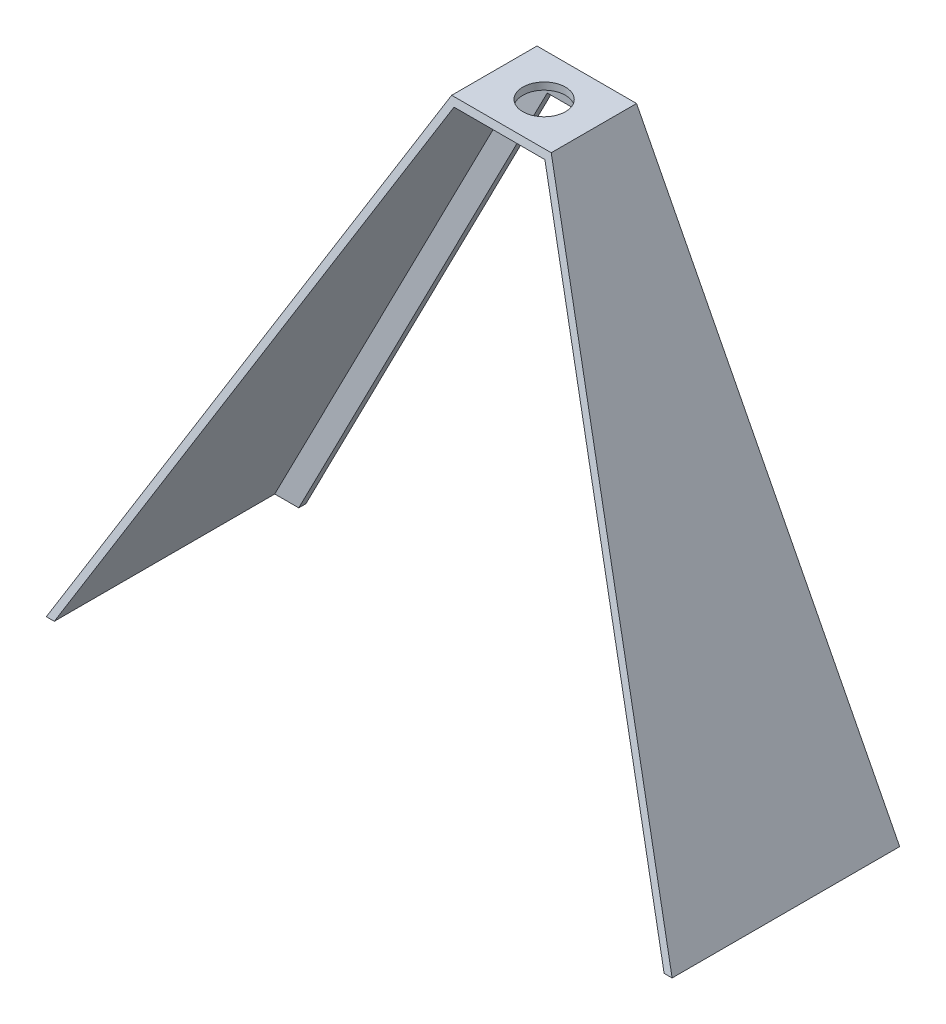
ISO-10303-21;
HEADER;
FILE_DESCRIPTION(('STEP AP214'),'2;1');
FILE_NAME('part.step','',(''),(''),'','','');
FILE_SCHEMA(('AUTOMOTIVE_DESIGN { 1 0 10303 214 1 1 1 1 }'));
ENDSEC;
DATA;
#1=APPLICATION_CONTEXT('core data for automotive mechanical design processes');
#2=APPLICATION_PROTOCOL_DEFINITION('international standard','automotive_design',2000,#1);
#3=PRODUCT_CONTEXT('',#1,'mechanical');
#4=PRODUCT('Part','Part','',(#3));
#5=PRODUCT_RELATED_PRODUCT_CATEGORY('part','',(#4));
#6=PRODUCT_DEFINITION_FORMATION('','',#4);
#7=PRODUCT_DEFINITION_CONTEXT('part definition',#1,'design');
#8=PRODUCT_DEFINITION('design','',#6,#7);
#9=PRODUCT_DEFINITION_SHAPE('','',#8);
#10=(LENGTH_UNIT() NAMED_UNIT(*) SI_UNIT(.MILLI.,.METRE.));
#11=(NAMED_UNIT(*) PLANE_ANGLE_UNIT() SI_UNIT($,.RADIAN.));
#12=(NAMED_UNIT(*) SI_UNIT($,.STERADIAN.) SOLID_ANGLE_UNIT());
#13=UNCERTAINTY_MEASURE_WITH_UNIT(LENGTH_MEASURE(1.E-05),#10,'distance_accuracy_value','');
#14=(GEOMETRIC_REPRESENTATION_CONTEXT(3) GLOBAL_UNCERTAINTY_ASSIGNED_CONTEXT((#13)) GLOBAL_UNIT_ASSIGNED_CONTEXT((#10,
#11,#12)) REPRESENTATION_CONTEXT('',''));
#15=CARTESIAN_POINT('',(0.,0.,0.));
#16=DIRECTION('',(0.,0.,1.));
#17=DIRECTION('',(1.,0.,0.));
#18=AXIS2_PLACEMENT_3D('',#15,#16,#17);
#19=CARTESIAN_POINT('',(279.4,1.04950770296597E-13,203.2));
#20=DIRECTION('',(0.,1.,0.));
#21=DIRECTION('',(-1.,0.,0.));
#22=AXIS2_PLACEMENT_3D('',#19,#20,#21);
#23=PLANE('',#22);
#24=DIRECTION('',(1.,0.,0.));
#25=VECTOR('',#24,1.);
#26=CARTESIAN_POINT('',(279.4,1.04950770296597E-13,0.));
#27=LINE('',#26,#25);
#28=CARTESIAN_POINT('',(-279.4,0.,0.));
#29=VERTEX_POINT('',#28);
#30=CARTESIAN_POINT('',(-250.842426438578,0.,0.));
#31=VERTEX_POINT('',#30);
#32=EDGE_CURVE('E196',#29,#31,#27,.T.);
#33=ORIENTED_EDGE('',*,*,#32,.T.);
#34=DIRECTION('',(0.,0.,-1.));
#35=VECTOR('',#34,1.);
#36=CARTESIAN_POINT('',(-250.842426438578,0.,203.2));
#37=LINE('',#36,#35);
#38=CARTESIAN_POINT('',(-250.842426438578,0.,6.34999999999999));
#39=VERTEX_POINT('',#38);
#40=EDGE_CURVE('E137',#39,#31,#37,.T.);
#41=ORIENTED_EDGE('',*,*,#40,.F.);
#42=DIRECTION('',(1.,0.,0.));
#43=VECTOR('',#42,1.);
#44=CARTESIAN_POINT('',(0.,0.,6.35));
#45=LINE('',#44,#43);
#46=CARTESIAN_POINT('',(-272.260606609644,0.,6.35));
#47=VERTEX_POINT('',#46);
#48=EDGE_CURVE('E161',#47,#39,#45,.T.);
#49=ORIENTED_EDGE('',*,*,#48,.F.);
#50=DIRECTION('',(0.,0.,-1.));
#51=VECTOR('',#50,1.);
#52=CARTESIAN_POINT('',(-272.260606609644,0.,203.2));
#53=LINE('',#52,#51);
#54=CARTESIAN_POINT('',(-272.260606609644,0.,203.2));
#55=VERTEX_POINT('',#54);
#56=EDGE_CURVE('E163',#55,#47,#53,.T.);
#57=ORIENTED_EDGE('',*,*,#56,.F.);
#58=DIRECTION('',(1.,0.,0.));
#59=VECTOR('',#58,1.);
#60=CARTESIAN_POINT('',(279.4,1.04950770296597E-13,203.2));
#61=LINE('',#60,#59);
#62=CARTESIAN_POINT('',(-279.4,0.,203.2));
#63=VERTEX_POINT('',#62);
#64=EDGE_CURVE('E191',#63,#55,#61,.T.);
#65=ORIENTED_EDGE('',*,*,#64,.F.);
#66=DIRECTION('',(0.,0.,-1.));
#67=VECTOR('',#66,1.);
#68=CARTESIAN_POINT('',(-279.4,0.,203.2));
#69=LINE('',#68,#67);
#70=EDGE_CURVE('E194',#63,#29,#69,.T.);
#71=ORIENTED_EDGE('',*,*,#70,.T.);
#72=EDGE_LOOP('',(#33,#41,#49,#57,#65,#71));
#73=FACE_BOUND('',#72,.T.);
#74=ADVANCED_FACE('F33',(#73),#23,.F.);
#75=CARTESIAN_POINT('',(250.842426438578,0.,6.34999999999999));
#76=VERTEX_POINT('',#75);
#77=CARTESIAN_POINT('',(272.260606609644,1.02745518157747E-13,6.35));
#78=VERTEX_POINT('',#77);
#79=EDGE_CURVE('E170',#76,#78,#45,.T.);
#80=ORIENTED_EDGE('',*,*,#79,.F.);
#81=DIRECTION('',(0.,0.,-1.));
#82=VECTOR('',#81,1.);
#83=CARTESIAN_POINT('',(250.842426438578,0.,203.2));
#84=LINE('',#83,#82);
#85=CARTESIAN_POINT('',(250.842426438578,0.,0.));
#86=VERTEX_POINT('',#85);
#87=EDGE_CURVE('E150',#76,#86,#84,.T.);
#88=ORIENTED_EDGE('',*,*,#87,.T.);
#89=CARTESIAN_POINT('',(279.4,1.04950770296597E-13,0.));
#90=VERTEX_POINT('',#89);
#91=EDGE_CURVE('E190',#86,#90,#27,.T.);
#92=ORIENTED_EDGE('',*,*,#91,.T.);
#93=DIRECTION('',(0.,0.,-1.));
#94=VECTOR('',#93,1.);
#95=CARTESIAN_POINT('',(279.4,1.04950770296597E-13,203.2));
#96=LINE('',#95,#94);
#97=CARTESIAN_POINT('',(279.4,1.04950770296597E-13,203.2));
#98=VERTEX_POINT('',#97);
#99=EDGE_CURVE('E212',#98,#90,#96,.T.);
#100=ORIENTED_EDGE('',*,*,#99,.F.);
#101=CARTESIAN_POINT('',(272.260606609644,1.06883910310131E-13,203.2));
#102=VERTEX_POINT('',#101);
#103=EDGE_CURVE('E195',#102,#98,#61,.T.);
#104=ORIENTED_EDGE('',*,*,#103,.F.);
#105=DIRECTION('',(0.,0.,-1.));
#106=VECTOR('',#105,1.);
#107=CARTESIAN_POINT('',(272.260606609644,1.11022302462516E-13,203.2));
#108=LINE('',#107,#106);
#109=EDGE_CURVE('E57',#102,#78,#108,.T.);
#110=ORIENTED_EDGE('',*,*,#109,.T.);
#111=EDGE_LOOP('',(#80,#88,#92,#100,#104,#110));
#112=FACE_BOUND('',#111,.T.);
#113=ADVANCED_FACE('F35',(#112),#23,.F.);
#114=CARTESIAN_POINT('',(44.4499999999999,457.2,203.2));
#115=DIRECTION('',(-0.889431307788423,-0.457068866502385,0.));
#116=DIRECTION('',(0.457068866502385,-0.889431307788424,0.));
#117=AXIS2_PLACEMENT_3D('',#114,#115,#116);
#118=PLANE('',#117);
#119=DIRECTION('',(0.,0.,-1.));
#120=VECTOR('',#119,1.);
#121=CARTESIAN_POINT('',(44.4499999999999,457.2,203.2));
#122=LINE('',#121,#120);
#123=CARTESIAN_POINT('',(44.4499999999999,457.2,76.2));
#124=VERTEX_POINT('',#123);
#125=CARTESIAN_POINT('',(44.4499999999999,457.2,0.));
#126=VERTEX_POINT('',#125);
#127=EDGE_CURVE('E210',#124,#126,#122,.T.);
#128=ORIENTED_EDGE('',*,*,#127,.F.);
#129=DIRECTION('',(0.443726748458519,-0.863468267270631,0.239852296464064));
#130=VECTOR('',#129,1.);
#131=CARTESIAN_POINT('',(57.966467711779,430.897684452754,83.5061987631238));
#132=LINE('',#131,#130);
#133=EDGE_CURVE('E187',#124,#98,#132,.T.);
#134=ORIENTED_EDGE('',*,*,#133,.T.);
#135=ORIENTED_EDGE('',*,*,#99,.T.);
#136=DIRECTION('',(-0.457068866502385,0.889431307788423,0.));
#137=VECTOR('',#136,1.);
#138=CARTESIAN_POINT('',(44.4499999999999,457.2,0.));
#139=LINE('',#138,#137);
#140=EDGE_CURVE('E198',#90,#126,#139,.T.);
#141=ORIENTED_EDGE('',*,*,#140,.T.);
#142=EDGE_LOOP('',(#128,#134,#135,#141));
#143=FACE_BOUND('',#142,.T.);
#144=ADVANCED_FACE('F228',(#143),#118,.F.);
#145=CARTESIAN_POINT('',(-44.4500000000001,457.2,203.2));
#146=DIRECTION('',(0.,-1.,0.));
#147=DIRECTION('',(0.,0.,-1.));
#148=AXIS2_PLACEMENT_3D('',#145,#146,#147);
#149=PLANE('',#148);
#150=CARTESIAN_POINT('',(-1.38777878078145E-13,457.2,38.1));
#151=DIRECTION('',(0.,1.,0.));
#152=DIRECTION('',(0.,0.,1.));
#153=AXIS2_PLACEMENT_3D('',#150,#151,#152);
#154=CIRCLE('',#153,19.05);
#155=CARTESIAN_POINT('',(-1.38777878078145E-13,457.2,57.15));
#156=VERTEX_POINT('',#155);
#157=EDGE_CURVE('E378',#156,#156,#154,.T.);
#158=ORIENTED_EDGE('',*,*,#157,.F.);
#159=EDGE_LOOP('',(#158));
#160=FACE_BOUND('',#159,.T.);
#161=DIRECTION('',(0.,0.,-1.));
#162=VECTOR('',#161,1.);
#163=CARTESIAN_POINT('',(-44.4500000000001,457.2,203.2));
#164=LINE('',#163,#162);
#165=CARTESIAN_POINT('',(-44.4500000000001,457.2,76.2));
#166=VERTEX_POINT('',#165);
#167=CARTESIAN_POINT('',(-44.4500000000001,457.2,0.));
#168=VERTEX_POINT('',#167);
#169=EDGE_CURVE('E208',#166,#168,#164,.T.);
#170=ORIENTED_EDGE('',*,*,#169,.F.);
#171=DIRECTION('',(1.,0.,0.));
#172=VECTOR('',#171,1.);
#173=CARTESIAN_POINT('',(-279.4,457.2,76.2));
#174=LINE('',#173,#172);
#175=EDGE_CURVE('E181',#166,#124,#174,.T.);
#176=ORIENTED_EDGE('',*,*,#175,.T.);
#177=ORIENTED_EDGE('',*,*,#127,.T.);
#178=DIRECTION('',(-1.,0.,0.));
#179=VECTOR('',#178,1.);
#180=CARTESIAN_POINT('',(-44.4500000000001,457.2,0.));
#181=LINE('',#180,#179);
#182=EDGE_CURVE('E201',#126,#168,#181,.T.);
#183=ORIENTED_EDGE('',*,*,#182,.T.);
#184=EDGE_LOOP('',(#170,#176,#177,#183));
#185=FACE_BOUND('',#184,.T.);
#186=ADVANCED_FACE('F233',(#160,#185),#149,.F.);
#187=CARTESIAN_POINT('',(-279.4,0.,203.2));
#188=DIRECTION('',(0.889431307788424,-0.457068866502384,0.));
#189=DIRECTION('',(0.457068866502384,0.889431307788424,0.));
#190=AXIS2_PLACEMENT_3D('',#187,#188,#189);
#191=PLANE('',#190);
#192=ORIENTED_EDGE('',*,*,#70,.F.);
#193=DIRECTION('',(0.443726748458518,0.863468267270631,-0.239852296464064));
#194=VECTOR('',#193,1.);
#195=CARTESIAN_POINT('',(-279.4,0.,203.2));
#196=LINE('',#195,#194);
#197=EDGE_CURVE('E184',#63,#166,#196,.T.);
#198=ORIENTED_EDGE('',*,*,#197,.T.);
#199=ORIENTED_EDGE('',*,*,#169,.T.);
#200=DIRECTION('',(-0.457068866502384,-0.889431307788424,0.));
#201=VECTOR('',#200,1.);
#202=CARTESIAN_POINT('',(-279.4,0.,0.));
#203=LINE('',#202,#201);
#204=EDGE_CURVE('E204',#168,#29,#203,.T.);
#205=ORIENTED_EDGE('',*,*,#204,.T.);
#206=EDGE_LOOP('',(#192,#198,#199,#205));
#207=FACE_BOUND('',#206,.T.);
#208=ADVANCED_FACE('F237',(#207),#191,.F.);
#209=CARTESIAN_POINT('',(0.,0.,0.));
#210=DIRECTION('',(0.,0.,-1.));
#211=DIRECTION('',(-1.,0.,0.));
#212=AXIS2_PLACEMENT_3D('',#209,#210,#211);
#213=PLANE('',#212);
#214=DIRECTION('',(0.457068866502384,0.889431307788424,0.));
#215=VECTOR('',#214,1.);
#216=CARTESIAN_POINT('',(-198.438446308193,101.975312686155,0.));
#217=LINE('',#216,#215);
#218=CARTESIAN_POINT('',(-28.9452042163555,431.8,0.));
#219=VERTEX_POINT('',#218);
#220=EDGE_CURVE('E134',#31,#219,#217,.T.);
#221=ORIENTED_EDGE('',*,*,#220,.F.);
#222=ORIENTED_EDGE('',*,*,#32,.F.);
#223=ORIENTED_EDGE('',*,*,#204,.F.);
#224=ORIENTED_EDGE('',*,*,#182,.F.);
#225=ORIENTED_EDGE('',*,*,#140,.F.);
#226=ORIENTED_EDGE('',*,*,#91,.F.);
#227=DIRECTION('',(0.457068866502385,-0.889431307788423,0.));
#228=VECTOR('',#227,1.);
#229=CARTESIAN_POINT('',(198.438446308193,101.975312686155,0.));
#230=LINE('',#229,#228);
#231=CARTESIAN_POINT('',(28.9452042163553,431.8,0.));
#232=VERTEX_POINT('',#231);
#233=EDGE_CURVE('E131',#232,#86,#230,.T.);
#234=ORIENTED_EDGE('',*,*,#233,.F.);
#235=DIRECTION('',(1.,0.,0.));
#236=VECTOR('',#235,1.);
#237=CARTESIAN_POINT('',(0.,431.8,0.));
#238=LINE('',#237,#236);
#239=EDGE_CURVE('E126',#219,#232,#238,.T.);
#240=ORIENTED_EDGE('',*,*,#239,.F.);
#241=EDGE_LOOP('',(#221,#222,#223,#224,#225,#226,#234,#240));
#242=FACE_BOUND('',#241,.T.);
#243=ADVANCED_FACE('F142',(#242),#213,.T.);
#244=CARTESIAN_POINT('',(-279.4,1.04950770296597E-13,203.2));
#245=DIRECTION('',(0.,-0.267643863786095,-0.963517909629941));
#246=DIRECTION('',(0.,0.963517909629941,-0.267643863786095));
#247=AXIS2_PLACEMENT_3D('',#244,#245,#246);
#248=PLANE('',#247);
#249=ORIENTED_EDGE('',*,*,#64,.T.);
#250=DIRECTION('',(0.443726748458518,0.863468267270631,-0.239852296464064));
#251=VECTOR('',#250,1.);
#252=CARTESIAN_POINT('',(-273.666306243097,-2.73541550293509,203.959837639704));
#253=LINE('',#252,#251);
#254=CARTESIAN_POINT('',(-40.573801054089,450.85,77.9638888888889));
#255=VERTEX_POINT('',#254);
#256=EDGE_CURVE('E171',#55,#255,#253,.T.);
#257=ORIENTED_EDGE('',*,*,#256,.T.);
#258=DIRECTION('',(1.,0.,0.));
#259=VECTOR('',#258,1.);
#260=CARTESIAN_POINT('',(-44.4500000000001,450.85,77.9638888888889));
#261=LINE('',#260,#259);
#262=CARTESIAN_POINT('',(40.5738010540887,450.85,77.9638888888889));
#263=VERTEX_POINT('',#262);
#264=EDGE_CURVE('E149',#255,#263,#261,.T.);
#265=ORIENTED_EDGE('',*,*,#264,.T.);
#266=DIRECTION('',(0.443726748458519,-0.863468267270631,0.239852296464064));
#267=VECTOR('',#266,1.);
#268=CARTESIAN_POINT('',(52.2327739548761,428.162268949819,84.266036402828));
#269=LINE('',#268,#267);
#270=EDGE_CURVE('E168',#263,#102,#269,.T.);
#271=ORIENTED_EDGE('',*,*,#270,.T.);
#272=ORIENTED_EDGE('',*,*,#103,.T.);
#273=ORIENTED_EDGE('',*,*,#133,.F.);
#274=ORIENTED_EDGE('',*,*,#175,.F.);
#275=ORIENTED_EDGE('',*,*,#197,.F.);
#276=EDGE_LOOP('',(#249,#257,#265,#271,#272,#273,#274,#275));
#277=FACE_BOUND('',#276,.T.);
#278=ADVANCED_FACE('F225',(#277),#248,.F.);
#279=CARTESIAN_POINT('',(38.8021111955434,454.29761269771,203.2));
#280=DIRECTION('',(-0.889431307788423,-0.457068866502385,0.));
#281=DIRECTION('',(0.457068866502385,-0.889431307788424,0.));
#282=AXIS2_PLACEMENT_3D('',#279,#280,#281);
#283=PLANE('',#282);
#284=DIRECTION('',(0.,0.,-1.));
#285=VECTOR('',#284,1.);
#286=CARTESIAN_POINT('',(40.5738010540887,450.85,203.2));
#287=LINE('',#286,#285);
#288=CARTESIAN_POINT('',(40.5738010540887,450.85,6.35));
#289=VERTEX_POINT('',#288);
#290=EDGE_CURVE('E154',#263,#289,#287,.T.);
#291=ORIENTED_EDGE('',*,*,#290,.T.);
#292=DIRECTION('',(-0.457068866502385,0.889431307788424,0.));
#293=VECTOR('',#292,1.);
#294=CARTESIAN_POINT('',(215.382112721562,110.682474593025,6.35));
#295=LINE('',#294,#293);
#296=EDGE_CURVE('E157',#78,#289,#295,.T.);
#297=ORIENTED_EDGE('',*,*,#296,.F.);
#298=ORIENTED_EDGE('',*,*,#109,.F.);
#299=ORIENTED_EDGE('',*,*,#270,.F.);
#300=EDGE_LOOP('',(#291,#297,#298,#299));
#301=FACE_BOUND('',#300,.T.);
#302=ADVANCED_FACE('F250',(#301),#283,.T.);
#303=CARTESIAN_POINT('',(-44.4500000000001,450.85,203.2));
#304=DIRECTION('',(0.,-1.,0.));
#305=DIRECTION('',(0.,0.,-1.));
#306=AXIS2_PLACEMENT_3D('',#303,#304,#305);
#307=PLANE('',#306);
#308=CARTESIAN_POINT('',(-1.38777878078145E-13,450.85,38.1));
#309=DIRECTION('',(0.,-1.,0.));
#310=DIRECTION('',(0.,0.,-1.));
#311=AXIS2_PLACEMENT_3D('',#308,#309,#310);
#312=CIRCLE('',#311,19.05);
#313=CARTESIAN_POINT('',(-1.38777878078145E-13,450.85,19.05));
#314=VERTEX_POINT('',#313);
#315=EDGE_CURVE('E37',#314,#314,#312,.T.);
#316=ORIENTED_EDGE('',*,*,#315,.F.);
#317=EDGE_LOOP('',(#316));
#318=FACE_BOUND('',#317,.T.);
#319=DIRECTION('',(0.,0.,-1.));
#320=VECTOR('',#319,1.);
#321=CARTESIAN_POINT('',(-40.573801054089,450.85,203.2));
#322=LINE('',#321,#320);
#323=CARTESIAN_POINT('',(-40.573801054089,450.85,6.35));
#324=VERTEX_POINT('',#323);
#325=EDGE_CURVE('E156',#255,#324,#322,.T.);
#326=ORIENTED_EDGE('',*,*,#325,.T.);
#327=DIRECTION('',(-1.,0.,0.));
#328=VECTOR('',#327,1.);
#329=CARTESIAN_POINT('',(0.,450.85,6.35));
#330=LINE('',#329,#328);
#331=EDGE_CURVE('E160',#289,#324,#330,.T.);
#332=ORIENTED_EDGE('',*,*,#331,.F.);
#333=ORIENTED_EDGE('',*,*,#290,.F.);
#334=ORIENTED_EDGE('',*,*,#264,.F.);
#335=EDGE_LOOP('',(#326,#332,#333,#334));
#336=FACE_BOUND('',#335,.T.);
#337=ADVANCED_FACE('F248',(#318,#336),#307,.T.);
#338=CARTESIAN_POINT('',(-273.752111195543,-2.90238730229021,203.2));
#339=DIRECTION('',(0.889431307788424,-0.457068866502384,0.));
#340=DIRECTION('',(0.457068866502384,0.889431307788424,0.));
#341=AXIS2_PLACEMENT_3D('',#338,#339,#340);
#342=PLANE('',#341);
#343=ORIENTED_EDGE('',*,*,#56,.T.);
#344=DIRECTION('',(-0.457068866502384,-0.889431307788424,0.));
#345=VECTOR('',#344,1.);
#346=CARTESIAN_POINT('',(-215.382112721562,110.682474593025,6.35));
#347=LINE('',#346,#345);
#348=EDGE_CURVE('E166',#324,#47,#347,.T.);
#349=ORIENTED_EDGE('',*,*,#348,.F.);
#350=ORIENTED_EDGE('',*,*,#325,.F.);
#351=ORIENTED_EDGE('',*,*,#256,.F.);
#352=EDGE_LOOP('',(#343,#349,#350,#351));
#353=FACE_BOUND('',#352,.T.);
#354=ADVANCED_FACE('F244',(#353),#342,.T.);
#355=CARTESIAN_POINT('',(0.,0.,6.35));
#356=DIRECTION('',(0.,0.,-1.));
#357=DIRECTION('',(-1.,0.,0.));
#358=AXIS2_PLACEMENT_3D('',#355,#356,#357);
#359=PLANE('',#358);
#360=ORIENTED_EDGE('',*,*,#48,.T.);
#361=DIRECTION('',(0.457068866502384,0.889431307788424,0.));
#362=VECTOR('',#361,1.);
#363=CARTESIAN_POINT('',(-198.438446308193,101.975312686155,6.35));
#364=LINE('',#363,#362);
#365=CARTESIAN_POINT('',(-28.9452042163555,431.8,6.34999999999999));
#366=VERTEX_POINT('',#365);
#367=EDGE_CURVE('E11',#39,#366,#364,.T.);
#368=ORIENTED_EDGE('',*,*,#367,.T.);
#369=DIRECTION('',(1.,0.,0.));
#370=VECTOR('',#369,1.);
#371=CARTESIAN_POINT('',(0.,431.8,6.35));
#372=LINE('',#371,#370);
#373=CARTESIAN_POINT('',(28.9452042163553,431.8,6.35));
#374=VERTEX_POINT('',#373);
#375=EDGE_CURVE('E129',#366,#374,#372,.T.);
#376=ORIENTED_EDGE('',*,*,#375,.T.);
#377=DIRECTION('',(0.457068866502385,-0.889431307788423,0.));
#378=VECTOR('',#377,1.);
#379=CARTESIAN_POINT('',(198.438446308193,101.975312686155,6.35));
#380=LINE('',#379,#378);
#381=EDGE_CURVE('E42',#374,#76,#380,.T.);
#382=ORIENTED_EDGE('',*,*,#381,.T.);
#383=ORIENTED_EDGE('',*,*,#79,.T.);
#384=ORIENTED_EDGE('',*,*,#296,.T.);
#385=ORIENTED_EDGE('',*,*,#331,.T.);
#386=ORIENTED_EDGE('',*,*,#348,.T.);
#387=EDGE_LOOP('',(#360,#368,#376,#382,#383,#384,#385,#386));
#388=FACE_BOUND('',#387,.T.);
#389=ADVANCED_FACE('F219',(#388),#359,.F.);
#390=CARTESIAN_POINT('',(-198.438446308193,101.975312686155,203.2));
#391=DIRECTION('',(-0.889431307788424,0.457068866502384,0.));
#392=DIRECTION('',(-0.457068866502384,-0.889431307788424,0.));
#393=AXIS2_PLACEMENT_3D('',#390,#391,#392);
#394=PLANE('',#393);
#395=ORIENTED_EDGE('',*,*,#40,.T.);
#396=ORIENTED_EDGE('',*,*,#220,.T.);
#397=DIRECTION('',(0.,0.,-1.));
#398=VECTOR('',#397,1.);
#399=CARTESIAN_POINT('',(-28.9452042163555,431.8,203.2));
#400=LINE('',#399,#398);
#401=EDGE_CURVE('E122',#366,#219,#400,.T.);
#402=ORIENTED_EDGE('',*,*,#401,.F.);
#403=ORIENTED_EDGE('',*,*,#367,.F.);
#404=EDGE_LOOP('',(#395,#396,#402,#403));
#405=FACE_BOUND('',#404,.T.);
#406=ADVANCED_FACE('F135',(#405),#394,.F.);
#407=CARTESIAN_POINT('',(198.438446308193,101.975312686155,203.2));
#408=DIRECTION('',(0.889431307788423,0.457068866502385,0.));
#409=DIRECTION('',(-0.457068866502385,0.889431307788423,0.));
#410=AXIS2_PLACEMENT_3D('',#407,#408,#409);
#411=PLANE('',#410);
#412=DIRECTION('',(0.,0.,-1.));
#413=VECTOR('',#412,1.);
#414=CARTESIAN_POINT('',(28.9452042163553,431.8,203.2));
#415=LINE('',#414,#413);
#416=EDGE_CURVE('E49',#374,#232,#415,.T.);
#417=ORIENTED_EDGE('',*,*,#416,.T.);
#418=ORIENTED_EDGE('',*,*,#233,.T.);
#419=ORIENTED_EDGE('',*,*,#87,.F.);
#420=ORIENTED_EDGE('',*,*,#381,.F.);
#421=EDGE_LOOP('',(#417,#418,#419,#420));
#422=FACE_BOUND('',#421,.T.);
#423=ADVANCED_FACE('F298',(#422),#411,.F.);
#424=CARTESIAN_POINT('',(0.,431.8,203.2));
#425=DIRECTION('',(0.,1.,0.));
#426=DIRECTION('',(0.,0.,1.));
#427=AXIS2_PLACEMENT_3D('',#424,#425,#426);
#428=PLANE('',#427);
#429=ORIENTED_EDGE('',*,*,#401,.T.);
#430=ORIENTED_EDGE('',*,*,#239,.T.);
#431=ORIENTED_EDGE('',*,*,#416,.F.);
#432=ORIENTED_EDGE('',*,*,#375,.F.);
#433=EDGE_LOOP('',(#429,#430,#431,#432));
#434=FACE_BOUND('',#433,.T.);
#435=ADVANCED_FACE('F124',(#434),#428,.F.);
#436=CARTESIAN_POINT('',(-1.38777878078145E-13,0.,38.1));
#437=DIRECTION('',(0.,1.,0.));
#438=DIRECTION('',(0.,0.,1.));
#439=AXIS2_PLACEMENT_3D('',#436,#437,#438);
#440=CYLINDRICAL_SURFACE('',#439,19.05);
#441=ORIENTED_EDGE('',*,*,#315,.T.);
#442=EDGE_LOOP('',(#441));
#443=FACE_BOUND('',#442,.T.);
#444=ORIENTED_EDGE('',*,*,#157,.T.);
#445=EDGE_LOOP('',(#444));
#446=FACE_BOUND('',#445,.T.);
#447=ADVANCED_FACE('F310',(#443,#446),#440,.F.);
#448=CLOSED_SHELL('',(#74,#113,#144,#186,#208,#243,#278,#302,#337,#354,#389,#406,#423,#435,#447));
#449=MANIFOLD_SOLID_BREP('B2',#448);
#450=ADVANCED_BREP_SHAPE_REPRESENTATION('',(#18,#449),#14);
#451=SHAPE_DEFINITION_REPRESENTATION(#9,#450);
ENDSEC;
END-ISO-10303-21;
